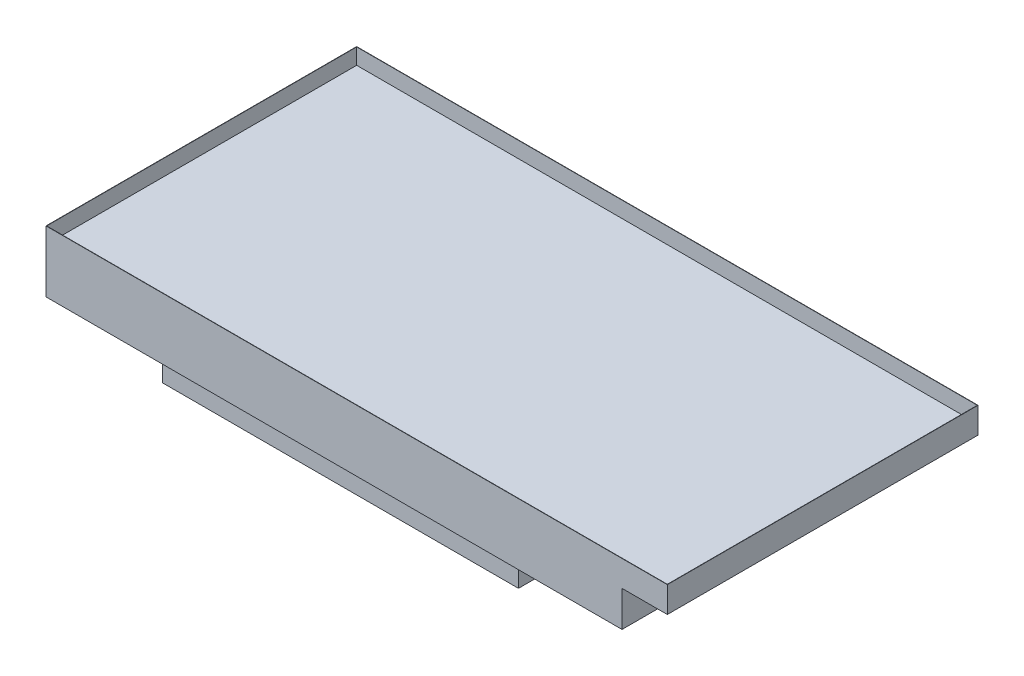
ISO-10303-21;
HEADER;
FILE_DESCRIPTION(('STEP AP214'),'2;1');
FILE_NAME('part.step','',(''),(''),'','','');
FILE_SCHEMA(('AUTOMOTIVE_DESIGN { 1 0 10303 214 1 1 1 1 }'));
ENDSEC;
DATA;
#1=APPLICATION_CONTEXT('core data for automotive mechanical design processes');
#2=APPLICATION_PROTOCOL_DEFINITION('international standard','automotive_design',2000,#1);
#3=PRODUCT_CONTEXT('',#1,'mechanical');
#4=PRODUCT('Part','Part','',(#3));
#5=PRODUCT_RELATED_PRODUCT_CATEGORY('part','',(#4));
#6=PRODUCT_DEFINITION_FORMATION('','',#4);
#7=PRODUCT_DEFINITION_CONTEXT('part definition',#1,'design');
#8=PRODUCT_DEFINITION('design','',#6,#7);
#9=PRODUCT_DEFINITION_SHAPE('','',#8);
#10=(LENGTH_UNIT() NAMED_UNIT(*) SI_UNIT(.MILLI.,.METRE.));
#11=(NAMED_UNIT(*) PLANE_ANGLE_UNIT() SI_UNIT($,.RADIAN.));
#12=(NAMED_UNIT(*) SI_UNIT($,.STERADIAN.) SOLID_ANGLE_UNIT());
#13=UNCERTAINTY_MEASURE_WITH_UNIT(LENGTH_MEASURE(1.E-05),#10,'distance_accuracy_value','');
#14=(GEOMETRIC_REPRESENTATION_CONTEXT(3) GLOBAL_UNCERTAINTY_ASSIGNED_CONTEXT((#13)) GLOBAL_UNIT_ASSIGNED_CONTEXT((#10,
#11,#12)) REPRESENTATION_CONTEXT('',''));
#15=CARTESIAN_POINT('',(0.,0.,0.));
#16=DIRECTION('',(0.,0.,1.));
#17=DIRECTION('',(1.,0.,0.));
#18=AXIS2_PLACEMENT_3D('',#15,#16,#17);
#19=CARTESIAN_POINT('',(-1376.91627906977,1090.13255813953,-2438.4));
#20=DIRECTION('',(0.,1.,0.));
#21=DIRECTION('',(0.,0.,1.));
#22=AXIS2_PLACEMENT_3D('',#19,#20,#21);
#23=PLANE('',#22);
#24=DIRECTION('',(-1.,0.,0.));
#25=VECTOR('',#24,1.);
#26=CARTESIAN_POINT('',(-1376.91627906977,1090.13255813953,0.));
#27=LINE('',#26,#25);
#28=CARTESIAN_POINT('',(3499.88372093023,1090.13255813953,0.));
#29=VERTEX_POINT('',#28);
#30=CARTESIAN_POINT('',(-1376.91627906977,1090.13255813953,0.));
#31=VERTEX_POINT('',#30);
#32=EDGE_CURVE('E311',#29,#31,#27,.T.);
#33=ORIENTED_EDGE('',*,*,#32,.F.);
#34=DIRECTION('',(0.,0.,1.));
#35=VECTOR('',#34,1.);
#36=CARTESIAN_POINT('',(3499.88372093023,1090.13255813953,-2438.4));
#37=LINE('',#36,#35);
#38=CARTESIAN_POINT('',(3499.88372093023,1090.13255813953,-2438.4));
#39=VERTEX_POINT('',#38);
#40=EDGE_CURVE('E68',#39,#29,#37,.T.);
#41=ORIENTED_EDGE('',*,*,#40,.F.);
#42=DIRECTION('',(-1.,0.,0.));
#43=VECTOR('',#42,1.);
#44=CARTESIAN_POINT('',(-1376.91627906977,1090.13255813953,-2438.4));
#45=LINE('',#44,#43);
#46=CARTESIAN_POINT('',(-1376.91627906977,1090.13255813953,-2438.4));
#47=VERTEX_POINT('',#46);
#48=EDGE_CURVE('E417',#39,#47,#45,.T.);
#49=ORIENTED_EDGE('',*,*,#48,.T.);
#50=DIRECTION('',(0.,0.,1.));
#51=VECTOR('',#50,1.);
#52=CARTESIAN_POINT('',(-1376.91627906977,1090.13255813953,-2438.4));
#53=LINE('',#52,#51);
#54=EDGE_CURVE('E13',#47,#31,#53,.T.);
#55=ORIENTED_EDGE('',*,*,#54,.T.);
#56=EDGE_LOOP('',(#33,#41,#49,#55));
#57=FACE_BOUND('',#56,.T.);
#58=DIRECTION('',(0.,0.,1.));
#59=VECTOR('',#58,1.);
#60=CARTESIAN_POINT('',(3497.34372093023,1090.13255813953,-2438.4));
#61=LINE('',#60,#59);
#62=CARTESIAN_POINT('',(3497.34372093023,1090.13255813953,-2435.86));
#63=VERTEX_POINT('',#62);
#64=CARTESIAN_POINT('',(3497.34372093023,1090.13255813953,-2.54));
#65=VERTEX_POINT('',#64);
#66=EDGE_CURVE('E293',#63,#65,#61,.T.);
#67=ORIENTED_EDGE('',*,*,#66,.T.);
#68=DIRECTION('',(-1.,0.,0.));
#69=VECTOR('',#68,1.);
#70=CARTESIAN_POINT('',(-1376.91627906977,1090.13255813953,-2.54000000000021));
#71=LINE('',#70,#69);
#72=CARTESIAN_POINT('',(-1374.37627906977,1090.13255813953,-2.54));
#73=VERTEX_POINT('',#72);
#74=EDGE_CURVE('E253',#65,#73,#71,.T.);
#75=ORIENTED_EDGE('',*,*,#74,.T.);
#76=DIRECTION('',(0.,0.,1.));
#77=VECTOR('',#76,1.);
#78=CARTESIAN_POINT('',(-1374.37627906977,1090.13255813953,-2438.4));
#79=LINE('',#78,#77);
#80=CARTESIAN_POINT('',(-1374.37627906977,1090.13255813953,-2435.86));
#81=VERTEX_POINT('',#80);
#82=EDGE_CURVE('E290',#81,#73,#79,.T.);
#83=ORIENTED_EDGE('',*,*,#82,.F.);
#84=DIRECTION('',(-1.,0.,0.));
#85=VECTOR('',#84,1.);
#86=CARTESIAN_POINT('',(-1376.91627906977,1090.13255813953,-2435.86));
#87=LINE('',#86,#85);
#88=EDGE_CURVE('E298',#63,#81,#87,.T.);
#89=ORIENTED_EDGE('',*,*,#88,.F.);
#90=EDGE_LOOP('',(#67,#75,#83,#89));
#91=FACE_BOUND('',#90,.T.);
#92=ADVANCED_FACE('F56',(#57,#91),#23,.T.);
#93=CARTESIAN_POINT('',(-1376.91627906977,607.532558139535,-2438.4));
#94=DIRECTION('',(-1.,0.,0.));
#95=DIRECTION('',(0.,-1.,0.));
#96=AXIS2_PLACEMENT_3D('',#93,#94,#95);
#97=PLANE('',#96);
#98=DIRECTION('',(0.,-1.,0.));
#99=VECTOR('',#98,1.);
#100=CARTESIAN_POINT('',(-1376.91627906977,607.532558139535,0.));
#101=LINE('',#100,#99);
#102=CARTESIAN_POINT('',(-1376.91627906977,607.532558139535,0.));
#103=VERTEX_POINT('',#102);
#104=EDGE_CURVE('E410',#31,#103,#101,.T.);
#105=ORIENTED_EDGE('',*,*,#104,.F.);
#106=ORIENTED_EDGE('',*,*,#54,.F.);
#107=DIRECTION('',(0.,-1.,0.));
#108=VECTOR('',#107,1.);
#109=CARTESIAN_POINT('',(-1376.91627906977,607.532558139535,-2438.4));
#110=LINE('',#109,#108);
#111=CARTESIAN_POINT('',(-1376.91627906977,607.532558139535,-2438.4));
#112=VERTEX_POINT('',#111);
#113=EDGE_CURVE('E362',#47,#112,#110,.T.);
#114=ORIENTED_EDGE('',*,*,#113,.T.);
#115=DIRECTION('',(0.,0.,1.));
#116=VECTOR('',#115,1.);
#117=CARTESIAN_POINT('',(-1376.91627906977,607.532558139535,-2438.4));
#118=LINE('',#117,#116);
#119=EDGE_CURVE('E60',#112,#103,#118,.T.);
#120=ORIENTED_EDGE('',*,*,#119,.T.);
#121=EDGE_LOOP('',(#105,#106,#114,#120));
#122=FACE_BOUND('',#121,.T.);
#123=ADVANCED_FACE('F58',(#122),#97,.T.);
#124=CARTESIAN_POINT('',(3499.88372093023,1090.13255813953,-2438.4));
#125=DIRECTION('',(1.,0.,0.));
#126=DIRECTION('',(0.,1.,0.));
#127=AXIS2_PLACEMENT_3D('',#124,#125,#126);
#128=PLANE('',#127);
#129=DIRECTION('',(0.,1.,0.));
#130=VECTOR('',#129,1.);
#131=CARTESIAN_POINT('',(3499.88372093023,1090.13255813953,0.));
#132=LINE('',#131,#130);
#133=CARTESIAN_POINT('',(3499.88372093023,886.932558139535,0.));
#134=VERTEX_POINT('',#133);
#135=EDGE_CURVE('E433',#134,#29,#132,.T.);
#136=ORIENTED_EDGE('',*,*,#135,.F.);
#137=DIRECTION('',(0.,0.,1.));
#138=VECTOR('',#137,1.);
#139=CARTESIAN_POINT('',(3499.88372093023,886.932558139535,-2438.4));
#140=LINE('',#139,#138);
#141=CARTESIAN_POINT('',(3499.88372093023,886.932558139535,-2438.4));
#142=VERTEX_POINT('',#141);
#143=EDGE_CURVE('E317',#142,#134,#140,.T.);
#144=ORIENTED_EDGE('',*,*,#143,.F.);
#145=DIRECTION('',(0.,1.,0.));
#146=VECTOR('',#145,1.);
#147=CARTESIAN_POINT('',(3499.88372093023,1090.13255813953,-2438.4));
#148=LINE('',#147,#146);
#149=EDGE_CURVE('E456',#142,#39,#148,.T.);
#150=ORIENTED_EDGE('',*,*,#149,.T.);
#151=ORIENTED_EDGE('',*,*,#40,.T.);
#152=EDGE_LOOP('',(#136,#144,#150,#151));
#153=FACE_BOUND('',#152,.T.);
#154=ADVANCED_FACE('F455',(#153),#128,.T.);
#155=CARTESIAN_POINT('',(3499.88372093023,886.932558139535,-2438.4));
#156=DIRECTION('',(0.,-1.,0.));
#157=DIRECTION('',(0.,0.,-1.));
#158=AXIS2_PLACEMENT_3D('',#155,#156,#157);
#159=PLANE('',#158);
#160=DIRECTION('',(1.,0.,0.));
#161=VECTOR('',#160,1.);
#162=CARTESIAN_POINT('',(3499.88372093023,886.932558139535,0.));
#163=LINE('',#162,#161);
#164=CARTESIAN_POINT('',(3144.28372093023,886.932558139535,0.));
#165=VERTEX_POINT('',#164);
#166=EDGE_CURVE('E427',#165,#134,#163,.T.);
#167=ORIENTED_EDGE('',*,*,#166,.F.);
#168=DIRECTION('',(0.,0.,1.));
#169=VECTOR('',#168,1.);
#170=CARTESIAN_POINT('',(3144.28372093023,886.932558139535,-2438.4));
#171=LINE('',#170,#169);
#172=CARTESIAN_POINT('',(3144.28372093023,886.932558139535,-2438.4));
#173=VERTEX_POINT('',#172);
#174=EDGE_CURVE('E387',#173,#165,#171,.T.);
#175=ORIENTED_EDGE('',*,*,#174,.F.);
#176=DIRECTION('',(1.,0.,0.));
#177=VECTOR('',#176,1.);
#178=CARTESIAN_POINT('',(3499.88372093023,886.932558139535,-2438.4));
#179=LINE('',#178,#177);
#180=EDGE_CURVE('E378',#173,#142,#179,.T.);
#181=ORIENTED_EDGE('',*,*,#180,.T.);
#182=ORIENTED_EDGE('',*,*,#143,.T.);
#183=EDGE_LOOP('',(#167,#175,#181,#182));
#184=FACE_BOUND('',#183,.T.);
#185=ADVANCED_FACE('F448',(#184),#159,.T.);
#186=CARTESIAN_POINT('',(3144.28372093023,886.932558139535,-2438.4));
#187=DIRECTION('',(1.,0.,0.));
#188=DIRECTION('',(0.,0.,-1.));
#189=AXIS2_PLACEMENT_3D('',#186,#187,#188);
#190=PLANE('',#189);
#191=DIRECTION('',(0.,1.,0.));
#192=VECTOR('',#191,1.);
#193=CARTESIAN_POINT('',(3144.28372093023,886.932558139535,0.));
#194=LINE('',#193,#192);
#195=CARTESIAN_POINT('',(3144.28372093023,607.532558139535,0.));
#196=VERTEX_POINT('',#195);
#197=EDGE_CURVE('E422',#196,#165,#194,.T.);
#198=ORIENTED_EDGE('',*,*,#197,.F.);
#199=DIRECTION('',(0.,0.,1.));
#200=VECTOR('',#199,1.);
#201=CARTESIAN_POINT('',(3144.28372093023,607.532558139535,-2438.4));
#202=LINE('',#201,#200);
#203=CARTESIAN_POINT('',(3144.28372093023,607.532558139535,-2438.4));
#204=VERTEX_POINT('',#203);
#205=EDGE_CURVE('E390',#204,#196,#202,.T.);
#206=ORIENTED_EDGE('',*,*,#205,.F.);
#207=DIRECTION('',(0.,1.,0.));
#208=VECTOR('',#207,1.);
#209=CARTESIAN_POINT('',(3144.28372093023,886.932558139535,-2438.4));
#210=LINE('',#209,#208);
#211=EDGE_CURVE('E374',#204,#173,#210,.T.);
#212=ORIENTED_EDGE('',*,*,#211,.T.);
#213=ORIENTED_EDGE('',*,*,#174,.T.);
#214=EDGE_LOOP('',(#198,#206,#212,#213));
#215=FACE_BOUND('',#214,.T.);
#216=ADVANCED_FACE('F504',(#215),#190,.T.);
#217=CARTESIAN_POINT('',(3144.28372093023,607.532558139535,-2438.4));
#218=DIRECTION('',(0.,-1.,0.));
#219=DIRECTION('',(0.,0.,-1.));
#220=AXIS2_PLACEMENT_3D('',#217,#218,#219);
#221=PLANE('',#220);
#222=DIRECTION('',(-1.,0.,0.));
#223=VECTOR('',#222,1.);
#224=CARTESIAN_POINT('',(2890.28372093023,607.532558139535,-457.2));
#225=LINE('',#224,#223);
#226=CARTESIAN_POINT('',(2229.88372093023,607.532558139535,-457.2));
#227=VERTEX_POINT('',#226);
#228=CARTESIAN_POINT('',(-919.716279069767,607.532558139535,-457.2));
#229=VERTEX_POINT('',#228);
#230=EDGE_CURVE('E500',#227,#229,#225,.T.);
#231=ORIENTED_EDGE('',*,*,#230,.F.);
#232=DIRECTION('',(0.,0.,1.));
#233=VECTOR('',#232,1.);
#234=CARTESIAN_POINT('',(2229.88372093023,607.532558139535,-2438.4));
#235=LINE('',#234,#233);
#236=CARTESIAN_POINT('',(2229.88372093023,607.532558139535,-2438.4));
#237=VERTEX_POINT('',#236);
#238=EDGE_CURVE('E395',#237,#227,#235,.T.);
#239=ORIENTED_EDGE('',*,*,#238,.F.);
#240=DIRECTION('',(1.,0.,0.));
#241=VECTOR('',#240,1.);
#242=CARTESIAN_POINT('',(3144.28372093023,607.532558139535,-2438.4));
#243=LINE('',#242,#241);
#244=EDGE_CURVE('E369',#237,#204,#243,.T.);
#245=ORIENTED_EDGE('',*,*,#244,.T.);
#246=ORIENTED_EDGE('',*,*,#205,.T.);
#247=DIRECTION('',(1.,0.,0.));
#248=VECTOR('',#247,1.);
#249=CARTESIAN_POINT('',(3144.28372093023,607.532558139535,0.));
#250=LINE('',#249,#248);
#251=EDGE_CURVE('E415',#103,#196,#250,.T.);
#252=ORIENTED_EDGE('',*,*,#251,.F.);
#253=ORIENTED_EDGE('',*,*,#119,.F.);
#254=DIRECTION('',(1.,0.,0.));
#255=VECTOR('',#254,1.);
#256=CARTESIAN_POINT('',(-1376.91627906977,607.532558139535,-2438.4));
#257=LINE('',#256,#255);
#258=CARTESIAN_POINT('',(-919.716279069767,607.532558139535,-2438.4));
#259=VERTEX_POINT('',#258);
#260=EDGE_CURVE('E358',#112,#259,#257,.T.);
#261=ORIENTED_EDGE('',*,*,#260,.T.);
#262=DIRECTION('',(0.,0.,1.));
#263=VECTOR('',#262,1.);
#264=CARTESIAN_POINT('',(-919.716279069767,607.532558139535,-2438.4));
#265=LINE('',#264,#263);
#266=EDGE_CURVE('E469',#259,#229,#265,.T.);
#267=ORIENTED_EDGE('',*,*,#266,.T.);
#268=EDGE_LOOP('',(#231,#239,#245,#246,#252,#253,#261,#267));
#269=FACE_BOUND('',#268,.T.);
#270=ADVANCED_FACE('F499',(#269),#221,.T.);
#271=CARTESIAN_POINT('',(2229.88372093023,607.532558139535,-2438.4));
#272=DIRECTION('',(1.,0.,0.));
#273=DIRECTION('',(0.,0.,-1.));
#274=AXIS2_PLACEMENT_3D('',#271,#272,#273);
#275=PLANE('',#274);
#276=DIRECTION('',(0.,1.,0.));
#277=VECTOR('',#276,1.);
#278=CARTESIAN_POINT('',(2229.88372093023,607.532558139536,-457.2));
#279=LINE('',#278,#277);
#280=CARTESIAN_POINT('',(2229.88372093023,328.132558139535,-457.2));
#281=VERTEX_POINT('',#280);
#282=EDGE_CURVE('E416',#281,#227,#279,.T.);
#283=ORIENTED_EDGE('',*,*,#282,.F.);
#284=DIRECTION('',(0.,0.,1.));
#285=VECTOR('',#284,1.);
#286=CARTESIAN_POINT('',(2229.88372093023,328.132558139535,-2438.4));
#287=LINE('',#286,#285);
#288=CARTESIAN_POINT('',(2229.88372093023,328.132558139535,-2438.4));
#289=VERTEX_POINT('',#288);
#290=EDGE_CURVE('E400',#289,#281,#287,.T.);
#291=ORIENTED_EDGE('',*,*,#290,.F.);
#292=DIRECTION('',(0.,1.,0.));
#293=VECTOR('',#292,1.);
#294=CARTESIAN_POINT('',(2229.88372093023,607.532558139535,-2438.4));
#295=LINE('',#294,#293);
#296=EDGE_CURVE('E343',#289,#237,#295,.T.);
#297=ORIENTED_EDGE('',*,*,#296,.T.);
#298=ORIENTED_EDGE('',*,*,#238,.T.);
#299=EDGE_LOOP('',(#283,#291,#297,#298));
#300=FACE_BOUND('',#299,.T.);
#301=ADVANCED_FACE('F508',(#300),#275,.T.);
#302=CARTESIAN_POINT('',(2229.88372093023,328.132558139535,-2438.4));
#303=DIRECTION('',(0.,-1.,0.));
#304=DIRECTION('',(0.,0.,-1.));
#305=AXIS2_PLACEMENT_3D('',#302,#303,#304);
#306=PLANE('',#305);
#307=DIRECTION('',(1.,0.,0.));
#308=VECTOR('',#307,1.);
#309=CARTESIAN_POINT('',(2229.88372093023,328.132558139535,-457.2));
#310=LINE('',#309,#308);
#311=CARTESIAN_POINT('',(1874.28372093023,328.132558139535,-457.2));
#312=VERTEX_POINT('',#311);
#313=EDGE_CURVE('E763',#312,#281,#310,.T.);
#314=ORIENTED_EDGE('',*,*,#313,.F.);
#315=DIRECTION('',(0.,0.,1.));
#316=VECTOR('',#315,1.);
#317=CARTESIAN_POINT('',(1874.28372093023,328.132558139535,-2438.4));
#318=LINE('',#317,#316);
#319=CARTESIAN_POINT('',(1874.28372093023,328.132558139535,-2438.4));
#320=VERTEX_POINT('',#319);
#321=EDGE_CURVE('E513',#320,#312,#318,.T.);
#322=ORIENTED_EDGE('',*,*,#321,.F.);
#323=DIRECTION('',(1.,0.,0.));
#324=VECTOR('',#323,1.);
#325=CARTESIAN_POINT('',(2229.88372093023,328.132558139535,-2438.4));
#326=LINE('',#325,#324);
#327=EDGE_CURVE('E335',#320,#289,#326,.T.);
#328=ORIENTED_EDGE('',*,*,#327,.T.);
#329=ORIENTED_EDGE('',*,*,#290,.T.);
#330=EDGE_LOOP('',(#314,#322,#328,#329));
#331=FACE_BOUND('',#330,.T.);
#332=ADVANCED_FACE('F770',(#331),#306,.T.);
#333=CARTESIAN_POINT('',(1874.28372093023,328.132558139535,-2438.4));
#334=DIRECTION('',(1.,0.,0.));
#335=DIRECTION('',(0.,1.,0.));
#336=AXIS2_PLACEMENT_3D('',#333,#334,#335);
#337=PLANE('',#336);
#338=DIRECTION('',(0.,1.,0.));
#339=VECTOR('',#338,1.);
#340=CARTESIAN_POINT('',(1874.28372093023,328.132558139536,-457.2));
#341=LINE('',#340,#339);
#342=CARTESIAN_POINT('',(1874.28372093023,23.332558139535,-457.2));
#343=VERTEX_POINT('',#342);
#344=EDGE_CURVE('E531',#343,#312,#341,.T.);
#345=ORIENTED_EDGE('',*,*,#344,.F.);
#346=DIRECTION('',(0.,0.,1.));
#347=VECTOR('',#346,1.);
#348=CARTESIAN_POINT('',(1874.28372093023,23.3325581395349,-2438.4));
#349=LINE('',#348,#347);
#350=CARTESIAN_POINT('',(1874.28372093023,23.3325581395349,-2438.4));
#351=VERTEX_POINT('',#350);
#352=EDGE_CURVE('E487',#351,#343,#349,.T.);
#353=ORIENTED_EDGE('',*,*,#352,.F.);
#354=DIRECTION('',(0.,1.,0.));
#355=VECTOR('',#354,1.);
#356=CARTESIAN_POINT('',(1874.28372093023,328.132558139535,-2438.4));
#357=LINE('',#356,#355);
#358=EDGE_CURVE('E329',#351,#320,#357,.T.);
#359=ORIENTED_EDGE('',*,*,#358,.T.);
#360=ORIENTED_EDGE('',*,*,#321,.T.);
#361=EDGE_LOOP('',(#345,#353,#359,#360));
#362=FACE_BOUND('',#361,.T.);
#363=ADVANCED_FACE('F771',(#362),#337,.T.);
#364=CARTESIAN_POINT('',(1874.28372093023,23.3325581395349,-2438.4));
#365=DIRECTION('',(0.,-1.,0.));
#366=DIRECTION('',(1.,0.,0.));
#367=AXIS2_PLACEMENT_3D('',#364,#365,#366);
#368=PLANE('',#367);
#369=DIRECTION('',(-1.,0.,0.));
#370=VECTOR('',#369,1.);
#371=CARTESIAN_POINT('',(2890.28372093023,23.3325581395352,-457.2));
#372=LINE('',#371,#370);
#373=CARTESIAN_POINT('',(-919.716279069767,23.3325581395345,-457.2));
#374=VERTEX_POINT('',#373);
#375=EDGE_CURVE('E527',#343,#374,#372,.T.);
#376=ORIENTED_EDGE('',*,*,#375,.T.);
#377=DIRECTION('',(0.,0.,1.));
#378=VECTOR('',#377,1.);
#379=CARTESIAN_POINT('',(-919.716279069767,23.3325581395345,-2438.4));
#380=LINE('',#379,#378);
#381=CARTESIAN_POINT('',(-919.716279069767,23.3325581395345,-2438.4));
#382=VERTEX_POINT('',#381);
#383=EDGE_CURVE('E473',#382,#374,#380,.T.);
#384=ORIENTED_EDGE('',*,*,#383,.F.);
#385=DIRECTION('',(1.,0.,0.));
#386=VECTOR('',#385,1.);
#387=CARTESIAN_POINT('',(1874.28372093023,23.3325581395349,-2438.4));
#388=LINE('',#387,#386);
#389=EDGE_CURVE('E336',#382,#351,#388,.T.);
#390=ORIENTED_EDGE('',*,*,#389,.T.);
#391=ORIENTED_EDGE('',*,*,#352,.T.);
#392=EDGE_LOOP('',(#376,#384,#390,#391));
#393=FACE_BOUND('',#392,.T.);
#394=ADVANCED_FACE('F486',(#393),#368,.T.);
#395=CARTESIAN_POINT('',(-919.716279069767,607.532558139535,-2438.4));
#396=DIRECTION('',(-1.,0.,0.));
#397=DIRECTION('',(0.,-1.,0.));
#398=AXIS2_PLACEMENT_3D('',#395,#396,#397);
#399=PLANE('',#398);
#400=DIRECTION('',(0.,-1.,0.));
#401=VECTOR('',#400,1.);
#402=CARTESIAN_POINT('',(-919.716279069767,607.532558139535,-457.2));
#403=LINE('',#402,#401);
#404=EDGE_CURVE('E497',#229,#374,#403,.T.);
#405=ORIENTED_EDGE('',*,*,#404,.F.);
#406=ORIENTED_EDGE('',*,*,#266,.F.);
#407=DIRECTION('',(0.,-1.,0.));
#408=VECTOR('',#407,1.);
#409=CARTESIAN_POINT('',(-919.716279069767,607.532558139535,-2438.4));
#410=LINE('',#409,#408);
#411=EDGE_CURVE('E353',#259,#382,#410,.T.);
#412=ORIENTED_EDGE('',*,*,#411,.T.);
#413=ORIENTED_EDGE('',*,*,#383,.T.);
#414=EDGE_LOOP('',(#405,#406,#412,#413));
#415=FACE_BOUND('',#414,.T.);
#416=ADVANCED_FACE('F496',(#415),#399,.T.);
#417=CARTESIAN_POINT('',(0.,0.,-2438.4));
#418=DIRECTION('',(0.,0.,-1.));
#419=DIRECTION('',(-1.,0.,0.));
#420=AXIS2_PLACEMENT_3D('',#417,#418,#419);
#421=PLANE('',#420);
#422=ORIENTED_EDGE('',*,*,#113,.F.);
#423=ORIENTED_EDGE('',*,*,#48,.F.);
#424=ORIENTED_EDGE('',*,*,#149,.F.);
#425=ORIENTED_EDGE('',*,*,#180,.F.);
#426=ORIENTED_EDGE('',*,*,#211,.F.);
#427=ORIENTED_EDGE('',*,*,#244,.F.);
#428=ORIENTED_EDGE('',*,*,#296,.F.);
#429=ORIENTED_EDGE('',*,*,#327,.F.);
#430=ORIENTED_EDGE('',*,*,#358,.F.);
#431=ORIENTED_EDGE('',*,*,#389,.F.);
#432=ORIENTED_EDGE('',*,*,#411,.F.);
#433=ORIENTED_EDGE('',*,*,#260,.F.);
#434=EDGE_LOOP('',(#422,#423,#424,#425,#426,#427,#428,#429,#430,#431,#432,#433));
#435=FACE_BOUND('',#434,.T.);
#436=ADVANCED_FACE('F492',(#435),#421,.T.);
#437=CARTESIAN_POINT('',(0.,0.,0.));
#438=DIRECTION('',(0.,0.,-1.));
#439=DIRECTION('',(-1.,0.,0.));
#440=AXIS2_PLACEMENT_3D('',#437,#438,#439);
#441=PLANE('',#440);
#442=ORIENTED_EDGE('',*,*,#104,.T.);
#443=ORIENTED_EDGE('',*,*,#251,.T.);
#444=ORIENTED_EDGE('',*,*,#197,.T.);
#445=ORIENTED_EDGE('',*,*,#166,.T.);
#446=ORIENTED_EDGE('',*,*,#135,.T.);
#447=ORIENTED_EDGE('',*,*,#32,.T.);
#448=EDGE_LOOP('',(#442,#443,#444,#445,#446,#447));
#449=FACE_BOUND('',#448,.T.);
#450=ADVANCED_FACE('F445',(#449),#441,.F.);
#451=CARTESIAN_POINT('',(2890.28372093023,607.532558139535,-457.2));
#452=DIRECTION('',(0.,0.,-1.));
#453=DIRECTION('',(0.,1.,0.));
#454=AXIS2_PLACEMENT_3D('',#451,#452,#453);
#455=PLANE('',#454);
#456=ORIENTED_EDGE('',*,*,#282,.T.);
#457=ORIENTED_EDGE('',*,*,#230,.T.);
#458=ORIENTED_EDGE('',*,*,#404,.T.);
#459=ORIENTED_EDGE('',*,*,#375,.F.);
#460=ORIENTED_EDGE('',*,*,#344,.T.);
#461=ORIENTED_EDGE('',*,*,#313,.T.);
#462=EDGE_LOOP('',(#456,#457,#458,#459,#460,#461));
#463=FACE_BOUND('',#462,.T.);
#464=ADVANCED_FACE('F769',(#463),#455,.F.);
#465=CARTESIAN_POINT('',(-1374.37627906977,607.532558139535,-2438.4));
#466=DIRECTION('',(-1.,0.,0.));
#467=DIRECTION('',(0.,-1.,0.));
#468=AXIS2_PLACEMENT_3D('',#465,#466,#467);
#469=PLANE('',#468);
#470=DIRECTION('',(0.,-1.,0.));
#471=VECTOR('',#470,1.);
#472=CARTESIAN_POINT('',(-1374.37627906977,607.532558139535,-2.54000000000021));
#473=LINE('',#472,#471);
#474=CARTESIAN_POINT('',(-1374.37627906977,964.910558139535,-2.54000000000021));
#475=VERTEX_POINT('',#474);
#476=EDGE_CURVE('E550',#73,#475,#473,.T.);
#477=ORIENTED_EDGE('',*,*,#476,.T.);
#478=DIRECTION('',(0.,0.,1.));
#479=VECTOR('',#478,1.);
#480=CARTESIAN_POINT('',(-1374.37627906977,964.910558139535,-2435.86));
#481=LINE('',#480,#479);
#482=CARTESIAN_POINT('',(-1374.37627906977,964.910558139535,-2435.86));
#483=VERTEX_POINT('',#482);
#484=EDGE_CURVE('E84',#483,#475,#481,.T.);
#485=ORIENTED_EDGE('',*,*,#484,.F.);
#486=DIRECTION('',(0.,-1.,0.));
#487=VECTOR('',#486,1.);
#488=CARTESIAN_POINT('',(-1374.37627906977,607.532558139535,-2435.86));
#489=LINE('',#488,#487);
#490=EDGE_CURVE('E544',#81,#483,#489,.T.);
#491=ORIENTED_EDGE('',*,*,#490,.F.);
#492=ORIENTED_EDGE('',*,*,#82,.T.);
#493=EDGE_LOOP('',(#477,#485,#491,#492));
#494=FACE_BOUND('',#493,.T.);
#495=ADVANCED_FACE('F840',(#494),#469,.F.);
#496=CARTESIAN_POINT('',(3497.34372093023,1090.13255813953,-2438.4));
#497=DIRECTION('',(1.,0.,0.));
#498=DIRECTION('',(0.,1.,0.));
#499=AXIS2_PLACEMENT_3D('',#496,#497,#498);
#500=PLANE('',#499);
#501=DIRECTION('',(0.,1.,0.));
#502=VECTOR('',#501,1.);
#503=CARTESIAN_POINT('',(3497.34372093023,1090.13255813953,-2435.86));
#504=LINE('',#503,#502);
#505=CARTESIAN_POINT('',(3497.34372093023,964.910558139535,-2435.86));
#506=VERTEX_POINT('',#505);
#507=EDGE_CURVE('E264',#506,#63,#504,.T.);
#508=ORIENTED_EDGE('',*,*,#507,.F.);
#509=DIRECTION('',(0.,0.,-1.));
#510=VECTOR('',#509,1.);
#511=CARTESIAN_POINT('',(3497.34372093023,964.910558139535,-2435.86));
#512=LINE('',#511,#510);
#513=CARTESIAN_POINT('',(3497.34372093023,964.910558139535,-2.53999999999999));
#514=VERTEX_POINT('',#513);
#515=EDGE_CURVE('E262',#514,#506,#512,.T.);
#516=ORIENTED_EDGE('',*,*,#515,.F.);
#517=DIRECTION('',(0.,1.,0.));
#518=VECTOR('',#517,1.);
#519=CARTESIAN_POINT('',(3497.34372093023,1090.13255813953,-2.54000000000021));
#520=LINE('',#519,#518);
#521=EDGE_CURVE('E246',#514,#65,#520,.T.);
#522=ORIENTED_EDGE('',*,*,#521,.T.);
#523=ORIENTED_EDGE('',*,*,#66,.F.);
#524=EDGE_LOOP('',(#508,#516,#522,#523));
#525=FACE_BOUND('',#524,.T.);
#526=ADVANCED_FACE('F263',(#525),#500,.F.);
#527=CARTESIAN_POINT('',(0.,0.,-2435.86));
#528=DIRECTION('',(0.,0.,-1.));
#529=DIRECTION('',(-1.,0.,0.));
#530=AXIS2_PLACEMENT_3D('',#527,#528,#529);
#531=PLANE('',#530);
#532=ORIENTED_EDGE('',*,*,#490,.T.);
#533=DIRECTION('',(-1.,0.,0.));
#534=VECTOR('',#533,1.);
#535=CARTESIAN_POINT('',(-1374.37627906977,964.910558139535,-2435.86));
#536=LINE('',#535,#534);
#537=EDGE_CURVE('E76',#506,#483,#536,.T.);
#538=ORIENTED_EDGE('',*,*,#537,.F.);
#539=ORIENTED_EDGE('',*,*,#507,.T.);
#540=ORIENTED_EDGE('',*,*,#88,.T.);
#541=EDGE_LOOP('',(#532,#538,#539,#540));
#542=FACE_BOUND('',#541,.T.);
#543=ADVANCED_FACE('F952',(#542),#531,.F.);
#544=CARTESIAN_POINT('',(0.,0.,-2.54));
#545=DIRECTION('',(0.,0.,-1.));
#546=DIRECTION('',(-1.,0.,0.));
#547=AXIS2_PLACEMENT_3D('',#544,#545,#546);
#548=PLANE('',#547);
#549=DIRECTION('',(1.,0.,0.));
#550=VECTOR('',#549,1.);
#551=CARTESIAN_POINT('',(-1374.37627906977,964.910558139535,-2.53999999999999));
#552=LINE('',#551,#550);
#553=EDGE_CURVE('E251',#475,#514,#552,.T.);
#554=ORIENTED_EDGE('',*,*,#553,.F.);
#555=ORIENTED_EDGE('',*,*,#476,.F.);
#556=ORIENTED_EDGE('',*,*,#74,.F.);
#557=ORIENTED_EDGE('',*,*,#521,.F.);
#558=EDGE_LOOP('',(#554,#555,#556,#557));
#559=FACE_BOUND('',#558,.T.);
#560=ADVANCED_FACE('F248',(#559),#548,.T.);
#561=CARTESIAN_POINT('',(0.,964.910558139535,0.));
#562=DIRECTION('',(0.,1.,0.));
#563=DIRECTION('',(0.,0.,1.));
#564=AXIS2_PLACEMENT_3D('',#561,#562,#563);
#565=PLANE('',#564);
#566=ORIENTED_EDGE('',*,*,#484,.T.);
#567=ORIENTED_EDGE('',*,*,#553,.T.);
#568=ORIENTED_EDGE('',*,*,#515,.T.);
#569=ORIENTED_EDGE('',*,*,#537,.T.);
#570=EDGE_LOOP('',(#566,#567,#568,#569));
#571=FACE_BOUND('',#570,.T.);
#572=ADVANCED_FACE('F268',(#571),#565,.T.);
#573=CLOSED_SHELL('',(#92,#123,#154,#185,#216,#270,#301,#332,#363,#394,#416,#436,#450,#464,#495,
#526,#543,#560,#572));
#574=CARTESIAN_POINT('',(2890.28372093023,607.532558139535,-459.74));
#575=DIRECTION('',(0.,0.,-1.));
#576=DIRECTION('',(0.,1.,0.));
#577=AXIS2_PLACEMENT_3D('',#574,#575,#576);
#578=PLANE('',#577);
#579=DIRECTION('',(0.,1.,0.));
#580=VECTOR('',#579,1.);
#581=CARTESIAN_POINT('',(2227.34372093023,607.532558139536,-459.74));
#582=LINE('',#581,#580);
#583=CARTESIAN_POINT('',(2227.34372093023,330.672558139535,-459.74));
#584=VERTEX_POINT('',#583);
#585=CARTESIAN_POINT('',(2227.34372093023,610.072558139535,-459.74));
#586=VERTEX_POINT('',#585);
#587=EDGE_CURVE('E673',#584,#586,#582,.T.);
#588=ORIENTED_EDGE('',*,*,#587,.F.);
#589=DIRECTION('',(1.,0.,0.));
#590=VECTOR('',#589,1.);
#591=CARTESIAN_POINT('',(2229.88372093023,330.672558139535,-459.74));
#592=LINE('',#591,#590);
#593=CARTESIAN_POINT('',(1871.74372093023,330.672558139535,-459.74));
#594=VERTEX_POINT('',#593);
#595=EDGE_CURVE('E678',#594,#584,#592,.T.);
#596=ORIENTED_EDGE('',*,*,#595,.F.);
#597=DIRECTION('',(0.,1.,0.));
#598=VECTOR('',#597,1.);
#599=CARTESIAN_POINT('',(1871.74372093023,328.132558139536,-459.74));
#600=LINE('',#599,#598);
#601=CARTESIAN_POINT('',(1871.74372093023,25.8725581395349,-459.74));
#602=VERTEX_POINT('',#601);
#603=EDGE_CURVE('E685',#602,#594,#600,.T.);
#604=ORIENTED_EDGE('',*,*,#603,.F.);
#605=DIRECTION('',(-1.,0.,0.));
#606=VECTOR('',#605,1.);
#607=CARTESIAN_POINT('',(2890.28372093023,25.872558139535,-459.74));
#608=LINE('',#607,#606);
#609=CARTESIAN_POINT('',(-917.176279069767,25.8725581395345,-459.74));
#610=VERTEX_POINT('',#609);
#611=EDGE_CURVE('E739',#602,#610,#608,.T.);
#612=ORIENTED_EDGE('',*,*,#611,.T.);
#613=DIRECTION('',(0.,-1.,0.));
#614=VECTOR('',#613,1.);
#615=CARTESIAN_POINT('',(-917.176279069767,607.532558139535,-459.74));
#616=LINE('',#615,#614);
#617=CARTESIAN_POINT('',(-917.176279069767,610.072558139535,-459.74));
#618=VERTEX_POINT('',#617);
#619=EDGE_CURVE('E732',#618,#610,#616,.T.);
#620=ORIENTED_EDGE('',*,*,#619,.F.);
#621=DIRECTION('',(-1.,0.,0.));
#622=VECTOR('',#621,1.);
#623=CARTESIAN_POINT('',(2890.28372093023,610.072558139535,-459.74));
#624=LINE('',#623,#622);
#625=EDGE_CURVE('E1061',#586,#618,#624,.T.);
#626=ORIENTED_EDGE('',*,*,#625,.F.);
#627=EDGE_LOOP('',(#588,#596,#604,#612,#620,#626));
#628=FACE_BOUND('',#627,.T.);
#629=ADVANCED_FACE('F893',(#628),#578,.T.);
#630=CARTESIAN_POINT('',(2227.34372093023,607.532558139535,-2438.4));
#631=DIRECTION('',(1.,0.,0.));
#632=DIRECTION('',(0.,0.,-1.));
#633=AXIS2_PLACEMENT_3D('',#630,#631,#632);
#634=PLANE('',#633);
#635=ORIENTED_EDGE('',*,*,#587,.T.);
#636=DIRECTION('',(0.,0.,1.));
#637=VECTOR('',#636,1.);
#638=CARTESIAN_POINT('',(2227.34372093023,610.072558139535,-2438.4));
#639=LINE('',#638,#637);
#640=CARTESIAN_POINT('',(2227.34372093023,610.072558139535,-2435.86));
#641=VERTEX_POINT('',#640);
#642=EDGE_CURVE('E642',#641,#586,#639,.T.);
#643=ORIENTED_EDGE('',*,*,#642,.F.);
#644=DIRECTION('',(0.,1.,0.));
#645=VECTOR('',#644,1.);
#646=CARTESIAN_POINT('',(2227.34372093023,607.532558139535,-2435.86));
#647=LINE('',#646,#645);
#648=CARTESIAN_POINT('',(2227.34372093023,330.672558139535,-2435.86));
#649=VERTEX_POINT('',#648);
#650=EDGE_CURVE('E629',#649,#641,#647,.T.);
#651=ORIENTED_EDGE('',*,*,#650,.F.);
#652=DIRECTION('',(0.,0.,1.));
#653=VECTOR('',#652,1.);
#654=CARTESIAN_POINT('',(2227.34372093023,330.672558139535,-2438.4));
#655=LINE('',#654,#653);
#656=EDGE_CURVE('E691',#649,#584,#655,.T.);
#657=ORIENTED_EDGE('',*,*,#656,.T.);
#658=EDGE_LOOP('',(#635,#643,#651,#657));
#659=FACE_BOUND('',#658,.T.);
#660=ADVANCED_FACE('F888',(#659),#634,.F.);
#661=CARTESIAN_POINT('',(2229.88372093023,330.672558139535,-2438.4));
#662=DIRECTION('',(0.,-1.,0.));
#663=DIRECTION('',(0.,0.,-1.));
#664=AXIS2_PLACEMENT_3D('',#661,#662,#663);
#665=PLANE('',#664);
#666=ORIENTED_EDGE('',*,*,#595,.T.);
#667=ORIENTED_EDGE('',*,*,#656,.F.);
#668=DIRECTION('',(1.,0.,0.));
#669=VECTOR('',#668,1.);
#670=CARTESIAN_POINT('',(2229.88372093023,330.672558139535,-2435.86));
#671=LINE('',#670,#669);
#672=CARTESIAN_POINT('',(1871.74372093023,330.672558139535,-2435.86));
#673=VERTEX_POINT('',#672);
#674=EDGE_CURVE('E714',#673,#649,#671,.T.);
#675=ORIENTED_EDGE('',*,*,#674,.F.);
#676=DIRECTION('',(0.,0.,1.));
#677=VECTOR('',#676,1.);
#678=CARTESIAN_POINT('',(1871.74372093023,330.672558139535,-2438.4));
#679=LINE('',#678,#677);
#680=EDGE_CURVE('E703',#673,#594,#679,.T.);
#681=ORIENTED_EDGE('',*,*,#680,.T.);
#682=EDGE_LOOP('',(#666,#667,#675,#681));
#683=FACE_BOUND('',#682,.T.);
#684=ADVANCED_FACE('F892',(#683),#665,.F.);
#685=CARTESIAN_POINT('',(1871.74372093023,328.132558139535,-2438.4));
#686=DIRECTION('',(1.,0.,0.));
#687=DIRECTION('',(0.,1.,0.));
#688=AXIS2_PLACEMENT_3D('',#685,#686,#687);
#689=PLANE('',#688);
#690=ORIENTED_EDGE('',*,*,#603,.T.);
#691=ORIENTED_EDGE('',*,*,#680,.F.);
#692=DIRECTION('',(0.,1.,0.));
#693=VECTOR('',#692,1.);
#694=CARTESIAN_POINT('',(1871.74372093023,328.132558139535,-2435.86));
#695=LINE('',#694,#693);
#696=CARTESIAN_POINT('',(1871.74372093023,25.8725581395349,-2435.86));
#697=VERTEX_POINT('',#696);
#698=EDGE_CURVE('E710',#697,#673,#695,.T.);
#699=ORIENTED_EDGE('',*,*,#698,.F.);
#700=DIRECTION('',(0.,0.,1.));
#701=VECTOR('',#700,1.);
#702=CARTESIAN_POINT('',(1871.74372093023,25.8725581395349,-2438.4));
#703=LINE('',#702,#701);
#704=EDGE_CURVE('E707',#697,#602,#703,.T.);
#705=ORIENTED_EDGE('',*,*,#704,.T.);
#706=EDGE_LOOP('',(#690,#691,#699,#705));
#707=FACE_BOUND('',#706,.T.);
#708=ADVANCED_FACE('F743',(#707),#689,.F.);
#709=CARTESIAN_POINT('',(1874.28372093023,25.8725581395349,-2438.4));
#710=DIRECTION('',(0.,-1.,0.));
#711=DIRECTION('',(1.,0.,0.));
#712=AXIS2_PLACEMENT_3D('',#709,#710,#711);
#713=PLANE('',#712);
#714=ORIENTED_EDGE('',*,*,#611,.F.);
#715=ORIENTED_EDGE('',*,*,#704,.F.);
#716=DIRECTION('',(1.,0.,0.));
#717=VECTOR('',#716,1.);
#718=CARTESIAN_POINT('',(1874.28372093023,25.8725581395349,-2435.86));
#719=LINE('',#718,#717);
#720=CARTESIAN_POINT('',(-917.176279069767,25.8725581395345,-2435.86));
#721=VERTEX_POINT('',#720);
#722=EDGE_CURVE('E715',#721,#697,#719,.T.);
#723=ORIENTED_EDGE('',*,*,#722,.F.);
#724=DIRECTION('',(0.,0.,1.));
#725=VECTOR('',#724,1.);
#726=CARTESIAN_POINT('',(-917.176279069767,25.8725581395346,-2438.4));
#727=LINE('',#726,#725);
#728=EDGE_CURVE('E579',#721,#610,#727,.T.);
#729=ORIENTED_EDGE('',*,*,#728,.T.);
#730=EDGE_LOOP('',(#714,#715,#723,#729));
#731=FACE_BOUND('',#730,.T.);
#732=ADVANCED_FACE('F736',(#731),#713,.F.);
#733=CARTESIAN_POINT('',(-917.176279069767,607.532558139535,-2438.4));
#734=DIRECTION('',(-1.,0.,0.));
#735=DIRECTION('',(0.,-1.,0.));
#736=AXIS2_PLACEMENT_3D('',#733,#734,#735);
#737=PLANE('',#736);
#738=ORIENTED_EDGE('',*,*,#619,.T.);
#739=ORIENTED_EDGE('',*,*,#728,.F.);
#740=DIRECTION('',(0.,-1.,0.));
#741=VECTOR('',#740,1.);
#742=CARTESIAN_POINT('',(-917.176279069767,607.532558139535,-2435.86));
#743=LINE('',#742,#741);
#744=CARTESIAN_POINT('',(-917.176279069767,610.072558139535,-2435.86));
#745=VERTEX_POINT('',#744);
#746=EDGE_CURVE('E570',#745,#721,#743,.T.);
#747=ORIENTED_EDGE('',*,*,#746,.F.);
#748=DIRECTION('',(0.,0.,1.));
#749=VECTOR('',#748,1.);
#750=CARTESIAN_POINT('',(-917.176279069767,610.072558139535,-2438.4));
#751=LINE('',#750,#749);
#752=EDGE_CURVE('E574',#745,#618,#751,.T.);
#753=ORIENTED_EDGE('',*,*,#752,.T.);
#754=EDGE_LOOP('',(#738,#739,#747,#753));
#755=FACE_BOUND('',#754,.T.);
#756=ADVANCED_FACE('F729',(#755),#737,.F.);
#757=CARTESIAN_POINT('',(3144.28372093023,610.072558139535,-2438.4));
#758=DIRECTION('',(0.,-1.,0.));
#759=DIRECTION('',(0.,0.,-1.));
#760=AXIS2_PLACEMENT_3D('',#757,#758,#759);
#761=PLANE('',#760);
#762=ORIENTED_EDGE('',*,*,#625,.T.);
#763=ORIENTED_EDGE('',*,*,#752,.F.);
#764=DIRECTION('',(1.,0.,0.));
#765=VECTOR('',#764,1.);
#766=CARTESIAN_POINT('',(3144.28372093023,610.072558139535,-2435.86));
#767=LINE('',#766,#765);
#768=CARTESIAN_POINT('',(-1374.37627906977,610.072558139535,-2435.86));
#769=VERTEX_POINT('',#768);
#770=EDGE_CURVE('E549',#769,#745,#767,.T.);
#771=ORIENTED_EDGE('',*,*,#770,.F.);
#772=DIRECTION('',(0.,0.,1.));
#773=VECTOR('',#772,1.);
#774=CARTESIAN_POINT('',(-1374.37627906977,610.072558139535,-2438.4));
#775=LINE('',#774,#773);
#776=CARTESIAN_POINT('',(-1374.37627906977,610.072558139535,-2.54));
#777=VERTEX_POINT('',#776);
#778=EDGE_CURVE('E553',#769,#777,#775,.T.);
#779=ORIENTED_EDGE('',*,*,#778,.T.);
#780=DIRECTION('',(1.,0.,0.));
#781=VECTOR('',#780,1.);
#782=CARTESIAN_POINT('',(3144.28372093023,610.072558139535,-2.54000000000021));
#783=LINE('',#782,#781);
#784=CARTESIAN_POINT('',(3141.74372093023,610.072558139535,-2.54));
#785=VERTEX_POINT('',#784);
#786=EDGE_CURVE('E571',#777,#785,#783,.T.);
#787=ORIENTED_EDGE('',*,*,#786,.T.);
#788=DIRECTION('',(0.,0.,1.));
#789=VECTOR('',#788,1.);
#790=CARTESIAN_POINT('',(3141.74372093023,610.072558139535,-2438.4));
#791=LINE('',#790,#789);
#792=CARTESIAN_POINT('',(3141.74372093023,610.072558139535,-2435.86));
#793=VERTEX_POINT('',#792);
#794=EDGE_CURVE('E644',#793,#785,#791,.T.);
#795=ORIENTED_EDGE('',*,*,#794,.F.);
#796=DIRECTION('',(1.,0.,0.));
#797=VECTOR('',#796,1.);
#798=CARTESIAN_POINT('',(3144.28372093023,610.072558139535,-2435.86));
#799=LINE('',#798,#797);
#800=EDGE_CURVE('E637',#641,#793,#799,.T.);
#801=ORIENTED_EDGE('',*,*,#800,.F.);
#802=ORIENTED_EDGE('',*,*,#642,.T.);
#803=EDGE_LOOP('',(#762,#763,#771,#779,#787,#795,#801,#802));
#804=FACE_BOUND('',#803,.T.);
#805=ADVANCED_FACE('F871',(#804),#761,.F.);
#806=CARTESIAN_POINT('',(3141.74372093023,886.932558139535,-2438.4));
#807=DIRECTION('',(1.,0.,0.));
#808=DIRECTION('',(0.,0.,-1.));
#809=AXIS2_PLACEMENT_3D('',#806,#807,#808);
#810=PLANE('',#809);
#811=DIRECTION('',(0.,1.,0.));
#812=VECTOR('',#811,1.);
#813=CARTESIAN_POINT('',(3141.74372093023,886.932558139535,-2.54000000000021));
#814=LINE('',#813,#812);
#815=CARTESIAN_POINT('',(3141.74372093023,889.472558139535,-2.54));
#816=VERTEX_POINT('',#815);
#817=EDGE_CURVE('E580',#785,#816,#814,.T.);
#818=ORIENTED_EDGE('',*,*,#817,.T.);
#819=DIRECTION('',(0.,0.,1.));
#820=VECTOR('',#819,1.);
#821=CARTESIAN_POINT('',(3141.74372093023,889.472558139535,-2438.4));
#822=LINE('',#821,#820);
#823=CARTESIAN_POINT('',(3141.74372093023,889.472558139535,-2435.86));
#824=VERTEX_POINT('',#823);
#825=EDGE_CURVE('E617',#824,#816,#822,.T.);
#826=ORIENTED_EDGE('',*,*,#825,.F.);
#827=DIRECTION('',(0.,1.,0.));
#828=VECTOR('',#827,1.);
#829=CARTESIAN_POINT('',(3141.74372093023,886.932558139535,-2435.86));
#830=LINE('',#829,#828);
#831=EDGE_CURVE('E641',#793,#824,#830,.T.);
#832=ORIENTED_EDGE('',*,*,#831,.F.);
#833=ORIENTED_EDGE('',*,*,#794,.T.);
#834=EDGE_LOOP('',(#818,#826,#832,#833));
#835=FACE_BOUND('',#834,.T.);
#836=ADVANCED_FACE('F859',(#835),#810,.F.);
#837=CARTESIAN_POINT('',(3499.88372093023,889.472558139535,-2438.4));
#838=DIRECTION('',(0.,-1.,0.));
#839=DIRECTION('',(0.,0.,-1.));
#840=AXIS2_PLACEMENT_3D('',#837,#838,#839);
#841=PLANE('',#840);
#842=DIRECTION('',(1.,0.,0.));
#843=VECTOR('',#842,1.);
#844=CARTESIAN_POINT('',(3499.88372093023,889.472558139535,-2.54000000000021));
#845=LINE('',#844,#843);
#846=CARTESIAN_POINT('',(3497.34372093023,889.472558139535,-2.54));
#847=VERTEX_POINT('',#846);
#848=EDGE_CURVE('E259',#816,#847,#845,.T.);
#849=ORIENTED_EDGE('',*,*,#848,.T.);
#850=DIRECTION('',(0.,0.,1.));
#851=VECTOR('',#850,1.);
#852=CARTESIAN_POINT('',(3497.34372093023,889.472558139535,-2438.4));
#853=LINE('',#852,#851);
#854=CARTESIAN_POINT('',(3497.34372093023,889.472558139535,-2435.86));
#855=VERTEX_POINT('',#854);
#856=EDGE_CURVE('E297',#855,#847,#853,.T.);
#857=ORIENTED_EDGE('',*,*,#856,.F.);
#858=DIRECTION('',(1.,0.,0.));
#859=VECTOR('',#858,1.);
#860=CARTESIAN_POINT('',(3499.88372093023,889.472558139535,-2435.86));
#861=LINE('',#860,#859);
#862=EDGE_CURVE('E618',#824,#855,#861,.T.);
#863=ORIENTED_EDGE('',*,*,#862,.F.);
#864=ORIENTED_EDGE('',*,*,#825,.T.);
#865=EDGE_LOOP('',(#849,#857,#863,#864));
#866=FACE_BOUND('',#865,.T.);
#867=ADVANCED_FACE('F853',(#866),#841,.F.);
#868=CARTESIAN_POINT('',(-1374.37627906977,963.132558139535,-2.53999999999999));
#869=VERTEX_POINT('',#868);
#870=EDGE_CURVE('E671',#869,#777,#473,.T.);
#871=ORIENTED_EDGE('',*,*,#870,.F.);
#872=DIRECTION('',(1.,0.,0.));
#873=VECTOR('',#872,1.);
#874=CARTESIAN_POINT('',(-1374.37627906977,963.132558139535,-2.53999999999999));
#875=LINE('',#874,#873);
#876=CARTESIAN_POINT('',(3497.34372093023,963.132558139535,-2.54000000000021));
#877=VERTEX_POINT('',#876);
#878=EDGE_CURVE('E597',#869,#877,#875,.T.);
#879=ORIENTED_EDGE('',*,*,#878,.T.);
#880=EDGE_CURVE('E258',#847,#877,#520,.T.);
#881=ORIENTED_EDGE('',*,*,#880,.F.);
#882=ORIENTED_EDGE('',*,*,#848,.F.);
#883=ORIENTED_EDGE('',*,*,#817,.F.);
#884=ORIENTED_EDGE('',*,*,#786,.F.);
#885=EDGE_LOOP('',(#871,#879,#881,#882,#883,#884));
#886=FACE_BOUND('',#885,.T.);
#887=ADVANCED_FACE('F858',(#886),#548,.T.);
#888=DIRECTION('',(-1.,0.,0.));
#889=VECTOR('',#888,1.);
#890=CARTESIAN_POINT('',(-1374.37627906977,963.132558139535,-2435.86));
#891=LINE('',#890,#889);
#892=CARTESIAN_POINT('',(3497.34372093023,963.132558139535,-2435.86));
#893=VERTEX_POINT('',#892);
#894=CARTESIAN_POINT('',(-1374.37627906977,963.132558139535,-2435.86));
#895=VERTEX_POINT('',#894);
#896=EDGE_CURVE('E272',#893,#895,#891,.T.);
#897=ORIENTED_EDGE('',*,*,#896,.T.);
#898=EDGE_CURVE('E289',#895,#769,#489,.T.);
#899=ORIENTED_EDGE('',*,*,#898,.T.);
#900=ORIENTED_EDGE('',*,*,#770,.T.);
#901=ORIENTED_EDGE('',*,*,#746,.T.);
#902=ORIENTED_EDGE('',*,*,#722,.T.);
#903=ORIENTED_EDGE('',*,*,#698,.T.);
#904=ORIENTED_EDGE('',*,*,#674,.T.);
#905=ORIENTED_EDGE('',*,*,#650,.T.);
#906=ORIENTED_EDGE('',*,*,#800,.T.);
#907=ORIENTED_EDGE('',*,*,#831,.T.);
#908=ORIENTED_EDGE('',*,*,#862,.T.);
#909=EDGE_CURVE('E623',#855,#893,#504,.T.);
#910=ORIENTED_EDGE('',*,*,#909,.T.);
#911=EDGE_LOOP('',(#897,#899,#900,#901,#902,#903,#904,#905,#906,#907,#908,#910));
#912=FACE_BOUND('',#911,.T.);
#913=ADVANCED_FACE('F726',(#912),#531,.F.);
#914=DIRECTION('',(0.,0.,-1.));
#915=VECTOR('',#914,1.);
#916=CARTESIAN_POINT('',(3497.34372093023,963.132558139535,-2435.86));
#917=LINE('',#916,#915);
#918=EDGE_CURVE('E603',#877,#893,#917,.T.);
#919=ORIENTED_EDGE('',*,*,#918,.T.);
#920=ORIENTED_EDGE('',*,*,#909,.F.);
#921=ORIENTED_EDGE('',*,*,#856,.T.);
#922=ORIENTED_EDGE('',*,*,#880,.T.);
#923=EDGE_LOOP('',(#919,#920,#921,#922));
#924=FACE_BOUND('',#923,.T.);
#925=ADVANCED_FACE('F954',(#924),#500,.F.);
#926=DIRECTION('',(0.,0.,1.));
#927=VECTOR('',#926,1.);
#928=CARTESIAN_POINT('',(-1374.37627906977,963.132558139535,-2435.86));
#929=LINE('',#928,#927);
#930=EDGE_CURVE('E592',#895,#869,#929,.T.);
#931=ORIENTED_EDGE('',*,*,#930,.T.);
#932=ORIENTED_EDGE('',*,*,#870,.T.);
#933=ORIENTED_EDGE('',*,*,#778,.F.);
#934=ORIENTED_EDGE('',*,*,#898,.F.);
#935=EDGE_LOOP('',(#931,#932,#933,#934));
#936=FACE_BOUND('',#935,.T.);
#937=ADVANCED_FACE('F945',(#936),#469,.F.);
#938=CARTESIAN_POINT('',(0.,963.132558139535,0.));
#939=DIRECTION('',(0.,1.,0.));
#940=DIRECTION('',(0.,0.,1.));
#941=AXIS2_PLACEMENT_3D('',#938,#939,#940);
#942=PLANE('',#941);
#943=ORIENTED_EDGE('',*,*,#930,.F.);
#944=ORIENTED_EDGE('',*,*,#896,.F.);
#945=ORIENTED_EDGE('',*,*,#918,.F.);
#946=ORIENTED_EDGE('',*,*,#878,.F.);
#947=EDGE_LOOP('',(#943,#944,#945,#946));
#948=FACE_BOUND('',#947,.T.);
#949=ADVANCED_FACE('F1004',(#948),#942,.F.);
#950=CLOSED_SHELL('',(#629,#660,#684,#708,#732,#756,#805,#836,#867,#887,#913,#925,#937,#949));
#951=ORIENTED_CLOSED_SHELL('',*,#950,.T.);
#952=BREP_WITH_VOIDS('B2',#573,(#951));
#953=ADVANCED_BREP_SHAPE_REPRESENTATION('',(#18,#952),#14);
#954=SHAPE_DEFINITION_REPRESENTATION(#9,#953);
ENDSEC;
END-ISO-10303-21;
